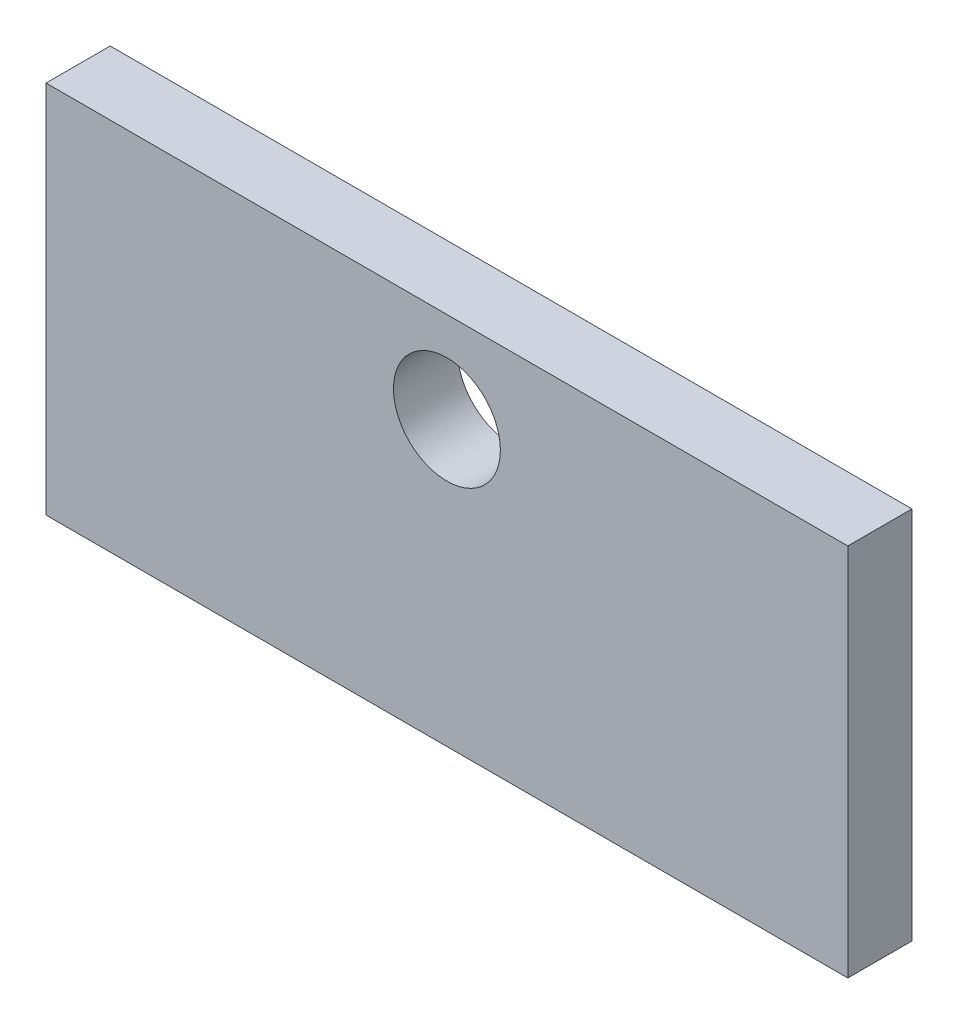
ISO-10303-21;
HEADER;
FILE_DESCRIPTION(('STEP AP214'),'2;1');
FILE_NAME('part.step','',(''),(''),'','','');
FILE_SCHEMA(('AUTOMOTIVE_DESIGN { 1 0 10303 214 1 1 1 1 }'));
ENDSEC;
DATA;
#1=APPLICATION_CONTEXT('core data for automotive mechanical design processes');
#2=APPLICATION_PROTOCOL_DEFINITION('international standard','automotive_design',2000,#1);
#3=PRODUCT_CONTEXT('',#1,'mechanical');
#4=PRODUCT('Part','Part','',(#3));
#5=PRODUCT_RELATED_PRODUCT_CATEGORY('part','',(#4));
#6=PRODUCT_DEFINITION_FORMATION('','',#4);
#7=PRODUCT_DEFINITION_CONTEXT('part definition',#1,'design');
#8=PRODUCT_DEFINITION('design','',#6,#7);
#9=PRODUCT_DEFINITION_SHAPE('','',#8);
#10=(LENGTH_UNIT() NAMED_UNIT(*) SI_UNIT(.MILLI.,.METRE.));
#11=(NAMED_UNIT(*) PLANE_ANGLE_UNIT() SI_UNIT($,.RADIAN.));
#12=(NAMED_UNIT(*) SI_UNIT($,.STERADIAN.) SOLID_ANGLE_UNIT());
#13=UNCERTAINTY_MEASURE_WITH_UNIT(LENGTH_MEASURE(1.E-05),#10,'distance_accuracy_value','');
#14=(GEOMETRIC_REPRESENTATION_CONTEXT(3) GLOBAL_UNCERTAINTY_ASSIGNED_CONTEXT((#13)) GLOBAL_UNIT_ASSIGNED_CONTEXT((#10,
#11,#12)) REPRESENTATION_CONTEXT('',''));
#15=CARTESIAN_POINT('',(0.,0.,0.));
#16=DIRECTION('',(0.,0.,1.));
#17=DIRECTION('',(1.,0.,0.));
#18=AXIS2_PLACEMENT_3D('',#15,#16,#17);
#19=CARTESIAN_POINT('',(150.,0.,12.));
#20=DIRECTION('',(0.,1.,0.));
#21=DIRECTION('',(-1.,0.,0.));
#22=AXIS2_PLACEMENT_3D('',#19,#20,#21);
#23=PLANE('',#22);
#24=DIRECTION('',(1.,0.,0.));
#25=VECTOR('',#24,1.);
#26=CARTESIAN_POINT('',(150.,0.,0.));
#27=LINE('',#26,#25);
#28=CARTESIAN_POINT('',(0.,0.,0.));
#29=VERTEX_POINT('',#28);
#30=CARTESIAN_POINT('',(150.,0.,0.));
#31=VERTEX_POINT('',#30);
#32=EDGE_CURVE('E107',#29,#31,#27,.T.);
#33=ORIENTED_EDGE('',*,*,#32,.T.);
#34=DIRECTION('',(0.,0.,-1.));
#35=VECTOR('',#34,1.);
#36=CARTESIAN_POINT('',(150.,0.,12.));
#37=LINE('',#36,#35);
#38=CARTESIAN_POINT('',(150.,0.,12.));
#39=VERTEX_POINT('',#38);
#40=EDGE_CURVE('E11',#39,#31,#37,.T.);
#41=ORIENTED_EDGE('',*,*,#40,.F.);
#42=DIRECTION('',(1.,0.,0.));
#43=VECTOR('',#42,1.);
#44=CARTESIAN_POINT('',(150.,0.,12.));
#45=LINE('',#44,#43);
#46=CARTESIAN_POINT('',(0.,0.,12.));
#47=VERTEX_POINT('',#46);
#48=EDGE_CURVE('E91',#47,#39,#45,.T.);
#49=ORIENTED_EDGE('',*,*,#48,.F.);
#50=DIRECTION('',(0.,0.,-1.));
#51=VECTOR('',#50,1.);
#52=CARTESIAN_POINT('',(0.,0.,12.));
#53=LINE('',#52,#51);
#54=EDGE_CURVE('E103',#47,#29,#53,.T.);
#55=ORIENTED_EDGE('',*,*,#54,.T.);
#56=EDGE_LOOP('',(#33,#41,#49,#55));
#57=FACE_BOUND('',#56,.T.);
#58=ADVANCED_FACE('F39',(#57),#23,.F.);
#59=CARTESIAN_POINT('',(150.,70.,12.));
#60=DIRECTION('',(-1.,0.,0.));
#61=DIRECTION('',(0.,0.,1.));
#62=AXIS2_PLACEMENT_3D('',#59,#60,#61);
#63=PLANE('',#62);
#64=DIRECTION('',(0.,1.,0.));
#65=VECTOR('',#64,1.);
#66=CARTESIAN_POINT('',(150.,70.,0.));
#67=LINE('',#66,#65);
#68=CARTESIAN_POINT('',(150.,70.,0.));
#69=VERTEX_POINT('',#68);
#70=EDGE_CURVE('E96',#31,#69,#67,.T.);
#71=ORIENTED_EDGE('',*,*,#70,.T.);
#72=DIRECTION('',(0.,0.,-1.));
#73=VECTOR('',#72,1.);
#74=CARTESIAN_POINT('',(150.,70.,12.));
#75=LINE('',#74,#73);
#76=CARTESIAN_POINT('',(150.,70.,12.));
#77=VERTEX_POINT('',#76);
#78=EDGE_CURVE('E48',#77,#69,#75,.T.);
#79=ORIENTED_EDGE('',*,*,#78,.F.);
#80=DIRECTION('',(0.,1.,0.));
#81=VECTOR('',#80,1.);
#82=CARTESIAN_POINT('',(150.,70.,12.));
#83=LINE('',#82,#81);
#84=EDGE_CURVE('E86',#39,#77,#83,.T.);
#85=ORIENTED_EDGE('',*,*,#84,.F.);
#86=ORIENTED_EDGE('',*,*,#40,.T.);
#87=EDGE_LOOP('',(#71,#79,#85,#86));
#88=FACE_BOUND('',#87,.T.);
#89=ADVANCED_FACE('F95',(#88),#63,.F.);
#90=CARTESIAN_POINT('',(0.,70.,12.));
#91=DIRECTION('',(0.,-1.,0.));
#92=DIRECTION('',(0.,0.,-1.));
#93=AXIS2_PLACEMENT_3D('',#90,#91,#92);
#94=PLANE('',#93);
#95=DIRECTION('',(-1.,0.,0.));
#96=VECTOR('',#95,1.);
#97=CARTESIAN_POINT('',(0.,70.,0.));
#98=LINE('',#97,#96);
#99=CARTESIAN_POINT('',(0.,70.,0.));
#100=VERTEX_POINT('',#99);
#101=EDGE_CURVE('E73',#69,#100,#98,.T.);
#102=ORIENTED_EDGE('',*,*,#101,.T.);
#103=DIRECTION('',(0.,0.,-1.));
#104=VECTOR('',#103,1.);
#105=CARTESIAN_POINT('',(0.,70.,12.));
#106=LINE('',#105,#104);
#107=CARTESIAN_POINT('',(0.,70.,12.));
#108=VERTEX_POINT('',#107);
#109=EDGE_CURVE('E98',#108,#100,#106,.T.);
#110=ORIENTED_EDGE('',*,*,#109,.F.);
#111=DIRECTION('',(-1.,0.,0.));
#112=VECTOR('',#111,1.);
#113=CARTESIAN_POINT('',(0.,70.,12.));
#114=LINE('',#113,#112);
#115=EDGE_CURVE('E89',#77,#108,#114,.T.);
#116=ORIENTED_EDGE('',*,*,#115,.F.);
#117=ORIENTED_EDGE('',*,*,#78,.T.);
#118=EDGE_LOOP('',(#102,#110,#116,#117));
#119=FACE_BOUND('',#118,.T.);
#120=ADVANCED_FACE('F99',(#119),#94,.F.);
#121=CARTESIAN_POINT('',(0.,0.,12.));
#122=DIRECTION('',(1.,0.,0.));
#123=DIRECTION('',(0.,0.,-1.));
#124=AXIS2_PLACEMENT_3D('',#121,#122,#123);
#125=PLANE('',#124);
#126=DIRECTION('',(0.,-1.,0.));
#127=VECTOR('',#126,1.);
#128=CARTESIAN_POINT('',(0.,0.,0.));
#129=LINE('',#128,#127);
#130=EDGE_CURVE('E79',#100,#29,#129,.T.);
#131=ORIENTED_EDGE('',*,*,#130,.T.);
#132=ORIENTED_EDGE('',*,*,#54,.F.);
#133=DIRECTION('',(0.,-1.,0.));
#134=VECTOR('',#133,1.);
#135=CARTESIAN_POINT('',(0.,0.,12.));
#136=LINE('',#135,#134);
#137=EDGE_CURVE('E56',#108,#47,#136,.T.);
#138=ORIENTED_EDGE('',*,*,#137,.F.);
#139=ORIENTED_EDGE('',*,*,#109,.T.);
#140=EDGE_LOOP('',(#131,#132,#138,#139));
#141=FACE_BOUND('',#140,.T.);
#142=ADVANCED_FACE('F121',(#141),#125,.F.);
#143=CARTESIAN_POINT('',(0.,0.,12.));
#144=DIRECTION('',(0.,0.,-1.));
#145=DIRECTION('',(-1.,0.,0.));
#146=AXIS2_PLACEMENT_3D('',#143,#144,#145);
#147=PLANE('',#146);
#148=CARTESIAN_POINT('',(75.,53.,12.));
#149=DIRECTION('',(0.,0.,1.));
#150=DIRECTION('',(1.,0.,0.));
#151=AXIS2_PLACEMENT_3D('',#148,#149,#150);
#152=CIRCLE('',#151,9.99999999999999);
#153=CARTESIAN_POINT('',(85.,53.,12.));
#154=VERTEX_POINT('',#153);
#155=EDGE_CURVE('E128',#154,#154,#152,.T.);
#156=ORIENTED_EDGE('',*,*,#155,.F.);
#157=EDGE_LOOP('',(#156));
#158=FACE_BOUND('',#157,.T.);
#159=ORIENTED_EDGE('',*,*,#48,.T.);
#160=ORIENTED_EDGE('',*,*,#84,.T.);
#161=ORIENTED_EDGE('',*,*,#115,.T.);
#162=ORIENTED_EDGE('',*,*,#137,.T.);
#163=EDGE_LOOP('',(#159,#160,#161,#162));
#164=FACE_BOUND('',#163,.T.);
#165=ADVANCED_FACE('F87',(#158,#164),#147,.F.);
#166=CARTESIAN_POINT('',(0.,0.,0.));
#167=DIRECTION('',(0.,0.,-1.));
#168=DIRECTION('',(-1.,0.,0.));
#169=AXIS2_PLACEMENT_3D('',#166,#167,#168);
#170=PLANE('',#169);
#171=CARTESIAN_POINT('',(75.,53.,0.));
#172=DIRECTION('',(0.,0.,1.));
#173=DIRECTION('',(1.,0.,0.));
#174=AXIS2_PLACEMENT_3D('',#171,#172,#173);
#175=CIRCLE('',#174,9.99999999999999);
#176=CARTESIAN_POINT('',(85.,53.,0.));
#177=VERTEX_POINT('',#176);
#178=EDGE_CURVE('E111',#177,#177,#175,.T.);
#179=ORIENTED_EDGE('',*,*,#178,.T.);
#180=EDGE_LOOP('',(#179));
#181=FACE_BOUND('',#180,.T.);
#182=ORIENTED_EDGE('',*,*,#32,.F.);
#183=ORIENTED_EDGE('',*,*,#130,.F.);
#184=ORIENTED_EDGE('',*,*,#101,.F.);
#185=ORIENTED_EDGE('',*,*,#70,.F.);
#186=EDGE_LOOP('',(#182,#183,#184,#185));
#187=FACE_BOUND('',#186,.T.);
#188=ADVANCED_FACE('F124',(#181,#187),#170,.T.);
#189=CARTESIAN_POINT('',(75.,53.,0.));
#190=DIRECTION('',(0.,0.,1.));
#191=DIRECTION('',(1.,0.,0.));
#192=AXIS2_PLACEMENT_3D('',#189,#190,#191);
#193=CYLINDRICAL_SURFACE('',#192,9.99999999999999);
#194=ORIENTED_EDGE('',*,*,#178,.F.);
#195=EDGE_LOOP('',(#194));
#196=FACE_BOUND('',#195,.T.);
#197=ORIENTED_EDGE('',*,*,#155,.T.);
#198=EDGE_LOOP('',(#197));
#199=FACE_BOUND('',#198,.T.);
#200=ADVANCED_FACE('F137',(#196,#199),#193,.F.);
#201=CLOSED_SHELL('',(#58,#89,#120,#142,#165,#188,#200));
#202=MANIFOLD_SOLID_BREP('B2',#201);
#203=ADVANCED_BREP_SHAPE_REPRESENTATION('',(#18,#202),#14);
#204=SHAPE_DEFINITION_REPRESENTATION(#9,#203);
ENDSEC;
END-ISO-10303-21;
